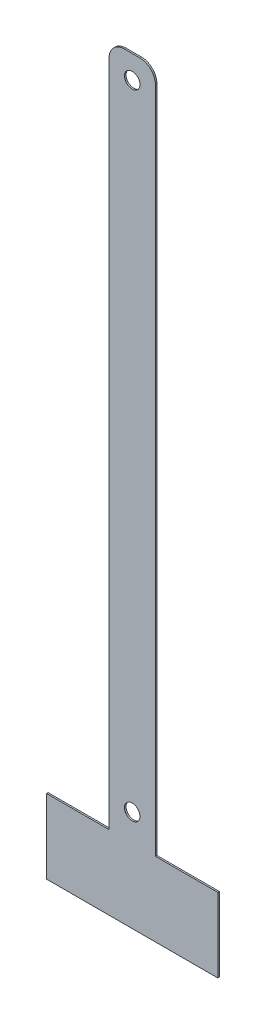
ISO-10303-21;
HEADER;
FILE_DESCRIPTION(('STEP AP214'),'2;1');
FILE_NAME('part.step','',(''),(''),'','','');
FILE_SCHEMA(('AUTOMOTIVE_DESIGN { 1 0 10303 214 1 1 1 1 }'));
ENDSEC;
DATA;
#1=APPLICATION_CONTEXT('core data for automotive mechanical design processes');
#2=APPLICATION_PROTOCOL_DEFINITION('international standard','automotive_design',2000,#1);
#3=PRODUCT_CONTEXT('',#1,'mechanical');
#4=PRODUCT('Part','Part','',(#3));
#5=PRODUCT_RELATED_PRODUCT_CATEGORY('part','',(#4));
#6=PRODUCT_DEFINITION_FORMATION('','',#4);
#7=PRODUCT_DEFINITION_CONTEXT('part definition',#1,'design');
#8=PRODUCT_DEFINITION('design','',#6,#7);
#9=PRODUCT_DEFINITION_SHAPE('','',#8);
#10=(LENGTH_UNIT() NAMED_UNIT(*) SI_UNIT(.MILLI.,.METRE.));
#11=(NAMED_UNIT(*) PLANE_ANGLE_UNIT() SI_UNIT($,.RADIAN.));
#12=(NAMED_UNIT(*) SI_UNIT($,.STERADIAN.) SOLID_ANGLE_UNIT());
#13=UNCERTAINTY_MEASURE_WITH_UNIT(LENGTH_MEASURE(1.E-05),#10,'distance_accuracy_value','');
#14=(GEOMETRIC_REPRESENTATION_CONTEXT(3) GLOBAL_UNCERTAINTY_ASSIGNED_CONTEXT((#13)) GLOBAL_UNIT_ASSIGNED_CONTEXT((#10,
#11,#12)) REPRESENTATION_CONTEXT('',''));
#15=CARTESIAN_POINT('',(0.,0.,0.));
#16=DIRECTION('',(0.,0.,1.));
#17=DIRECTION('',(1.,0.,0.));
#18=AXIS2_PLACEMENT_3D('',#15,#16,#17);
#19=CARTESIAN_POINT('',(0.,0.,1.));
#20=DIRECTION('',(0.,0.,1.));
#21=DIRECTION('',(1.,0.,0.));
#22=AXIS2_PLACEMENT_3D('',#19,#20,#21);
#23=PLANE('',#22);
#24=DIRECTION('',(-1.,0.,0.));
#25=VECTOR('',#24,1.);
#26=CARTESIAN_POINT('',(1.24668793806866E-13,-490.356194490192,1.00000000000022));
#27=LINE('',#26,#25);
#28=CARTESIAN_POINT('',(70.3561944901926,-490.356194490192,0.99999999999989));
#29=VERTEX_POINT('',#28);
#30=CARTESIAN_POINT('',(-40.3561944901921,-490.356194490192,1.00000000000011));
#31=VERTEX_POINT('',#30);
#32=EDGE_CURVE('E279',#29,#31,#27,.T.);
#33=ORIENTED_EDGE('',*,*,#32,.F.);
#34=DIRECTION('',(0.,1.,0.));
#35=VECTOR('',#34,1.);
#36=CARTESIAN_POINT('',(70.3561944901926,-490.356194490192,0.99999999999989));
#37=LINE('',#36,#35);
#38=CARTESIAN_POINT('',(70.3561944901926,-442.356194490192,0.999999999999612));
#39=VERTEX_POINT('',#38);
#40=EDGE_CURVE('E234',#39,#29,#37,.F.);
#41=ORIENTED_EDGE('',*,*,#40,.F.);
#42=DIRECTION('',(-1.,0.,0.));
#43=VECTOR('',#42,1.);
#44=CARTESIAN_POINT('',(32.3561944901927,-442.356194490192,0.999999999999834));
#45=LINE('',#44,#43);
#46=CARTESIAN_POINT('',(30.0000000000001,-442.356194490192,0.999999999999834));
#47=VERTEX_POINT('',#46);
#48=EDGE_CURVE('E253',#39,#47,#45,.T.);
#49=ORIENTED_EDGE('',*,*,#48,.T.);
#50=DIRECTION('',(0.,1.,0.));
#51=VECTOR('',#50,1.);
#52=CARTESIAN_POINT('',(30.0000000000001,-441.178097245096,1.));
#53=LINE('',#52,#51);
#54=CARTESIAN_POINT('',(30.,-10.,1.));
#55=VERTEX_POINT('',#54);
#56=EDGE_CURVE('E232',#47,#55,#53,.T.);
#57=ORIENTED_EDGE('',*,*,#56,.T.);
#58=CARTESIAN_POINT('',(20.,-10.,1.));
#59=DIRECTION('',(0.,0.,1.));
#60=DIRECTION('',(1.,0.,0.));
#61=AXIS2_PLACEMENT_3D('',#58,#59,#60);
#62=CIRCLE('',#61,10.);
#63=CARTESIAN_POINT('',(20.,0.,1.));
#64=VERTEX_POINT('',#63);
#65=EDGE_CURVE('E298',#55,#64,#62,.T.);
#66=ORIENTED_EDGE('',*,*,#65,.T.);
#67=DIRECTION('',(1.,0.,0.));
#68=VECTOR('',#67,1.);
#69=CARTESIAN_POINT('',(0.,0.,1.));
#70=LINE('',#69,#68);
#71=CARTESIAN_POINT('',(10.,0.,1.));
#72=VERTEX_POINT('',#71);
#73=EDGE_CURVE('E324',#72,#64,#70,.T.);
#74=ORIENTED_EDGE('',*,*,#73,.F.);
#75=CARTESIAN_POINT('',(10.,-10.,1.));
#76=DIRECTION('',(0.,0.,1.));
#77=DIRECTION('',(1.,0.,0.));
#78=AXIS2_PLACEMENT_3D('',#75,#76,#77);
#79=CIRCLE('',#78,10.);
#80=CARTESIAN_POINT('',(0.,-10.,1.));
#81=VERTEX_POINT('',#80);
#82=EDGE_CURVE('E321',#72,#81,#79,.T.);
#83=ORIENTED_EDGE('',*,*,#82,.T.);
#84=DIRECTION('',(0.,1.,0.));
#85=VECTOR('',#84,1.);
#86=CARTESIAN_POINT('',(1.35308431126191E-13,-441.178097245096,1.));
#87=LINE('',#86,#85);
#88=CARTESIAN_POINT('',(1.35308431126191E-13,-442.356194490192,1.));
#89=VERTEX_POINT('',#88);
#90=EDGE_CURVE('E203',#81,#89,#87,.F.);
#91=ORIENTED_EDGE('',*,*,#90,.T.);
#92=DIRECTION('',(-1.,0.,0.));
#93=VECTOR('',#92,1.);
#94=CARTESIAN_POINT('',(1.24768373731876E-13,-442.356194490192,1.));
#95=LINE('',#94,#93);
#96=CARTESIAN_POINT('',(-40.3561944901921,-442.356194490192,0.999999999999779));
#97=VERTEX_POINT('',#96);
#98=EDGE_CURVE('E273',#89,#97,#95,.T.);
#99=ORIENTED_EDGE('',*,*,#98,.T.);
#100=DIRECTION('',(0.,-1.,0.));
#101=VECTOR('',#100,1.);
#102=CARTESIAN_POINT('',(-40.3561944901921,-442.356194490192,0.999999999999779));
#103=LINE('',#102,#101);
#104=EDGE_CURVE('E256',#31,#97,#103,.F.);
#105=ORIENTED_EDGE('',*,*,#104,.F.);
#106=EDGE_LOOP('',(#33,#41,#49,#57,#66,#74,#83,#91,#99,#105));
#107=FACE_BOUND('',#106,.T.);
#108=CARTESIAN_POINT('',(15.,-425.,1.));
#109=DIRECTION('',(0.,0.,1.));
#110=DIRECTION('',(1.,0.,0.));
#111=AXIS2_PLACEMENT_3D('',#108,#109,#110);
#112=CIRCLE('',#111,4.99999999999999);
#113=CARTESIAN_POINT('',(20.,-425.,1.));
#114=VERTEX_POINT('',#113);
#115=EDGE_CURVE('E310',#114,#114,#112,.F.);
#116=ORIENTED_EDGE('',*,*,#115,.T.);
#117=EDGE_LOOP('',(#116));
#118=FACE_BOUND('',#117,.T.);
#119=CARTESIAN_POINT('',(15.,-15.,1.));
#120=DIRECTION('',(0.,0.,1.));
#121=DIRECTION('',(1.,0.,0.));
#122=AXIS2_PLACEMENT_3D('',#119,#120,#121);
#123=CIRCLE('',#122,5.);
#124=CARTESIAN_POINT('',(20.,-15.,1.));
#125=VERTEX_POINT('',#124);
#126=EDGE_CURVE('E226',#125,#125,#123,.T.);
#127=ORIENTED_EDGE('',*,*,#126,.F.);
#128=EDGE_LOOP('',(#127));
#129=FACE_BOUND('',#128,.T.);
#130=ADVANCED_FACE('F109',(#107,#118,#129),#23,.T.);
#131=CARTESIAN_POINT('',(0.,-441.356194490191,-1.11022302462516E-13));
#132=DIRECTION('',(0.,0.,1.));
#133=DIRECTION('',(0.,-1.,0.));
#134=AXIS2_PLACEMENT_3D('',#131,#132,#133);
#135=PLANE('',#134);
#136=DIRECTION('',(1.,0.,0.));
#137=VECTOR('',#136,1.);
#138=CARTESIAN_POINT('',(0.,-490.356194490192,2.22044604925031E-13));
#139=LINE('',#138,#137);
#140=CARTESIAN_POINT('',(70.3561944901926,-490.356194490192,-1.11022302462516E-13));
#141=VERTEX_POINT('',#140);
#142=CARTESIAN_POINT('',(-40.3561944901921,-490.356194490192,1.11022302462516E-13));
#143=VERTEX_POINT('',#142);
#144=EDGE_CURVE('E276',#141,#143,#139,.F.);
#145=ORIENTED_EDGE('',*,*,#144,.T.);
#146=DIRECTION('',(0.,1.,0.));
#147=VECTOR('',#146,1.);
#148=CARTESIAN_POINT('',(-40.3561944901921,-441.356194490191,-2.22044604925031E-13));
#149=LINE('',#148,#147);
#150=CARTESIAN_POINT('',(-40.3561944901921,-442.356194490192,-2.22044604925031E-13));
#151=VERTEX_POINT('',#150);
#152=EDGE_CURVE('E259',#143,#151,#149,.T.);
#153=ORIENTED_EDGE('',*,*,#152,.T.);
#154=DIRECTION('',(1.,0.,0.));
#155=VECTOR('',#154,1.);
#156=CARTESIAN_POINT('',(-1.17809724509605,-442.356194490192,0.));
#157=LINE('',#156,#155);
#158=CARTESIAN_POINT('',(1.24668793806866E-13,-442.356194490192,0.));
#159=VERTEX_POINT('',#158);
#160=EDGE_CURVE('E124',#159,#151,#157,.F.);
#161=ORIENTED_EDGE('',*,*,#160,.F.);
#162=DIRECTION('',(0.,1.,0.));
#163=VECTOR('',#162,1.);
#164=CARTESIAN_POINT('',(1.35308431126191E-13,-441.178097245096,0.));
#165=LINE('',#164,#163);
#166=CARTESIAN_POINT('',(0.,-10.,0.));
#167=VERTEX_POINT('',#166);
#168=EDGE_CURVE('E186',#167,#159,#165,.F.);
#169=ORIENTED_EDGE('',*,*,#168,.F.);
#170=CARTESIAN_POINT('',(10.,-10.,0.));
#171=DIRECTION('',(0.,0.,1.));
#172=DIRECTION('',(1.,0.,0.));
#173=AXIS2_PLACEMENT_3D('',#170,#171,#172);
#174=CIRCLE('',#173,10.);
#175=CARTESIAN_POINT('',(10.,0.,0.));
#176=VERTEX_POINT('',#175);
#177=EDGE_CURVE('E192',#176,#167,#174,.T.);
#178=ORIENTED_EDGE('',*,*,#177,.F.);
#179=DIRECTION('',(1.,0.,0.));
#180=VECTOR('',#179,1.);
#181=CARTESIAN_POINT('',(0.,0.,0.));
#182=LINE('',#181,#180);
#183=CARTESIAN_POINT('',(20.,0.,0.));
#184=VERTEX_POINT('',#183);
#185=EDGE_CURVE('E309',#176,#184,#182,.T.);
#186=ORIENTED_EDGE('',*,*,#185,.T.);
#187=CARTESIAN_POINT('',(20.,-10.,0.));
#188=DIRECTION('',(0.,0.,1.));
#189=DIRECTION('',(1.,0.,0.));
#190=AXIS2_PLACEMENT_3D('',#187,#188,#189);
#191=CIRCLE('',#190,10.);
#192=CARTESIAN_POINT('',(30.,-10.,0.));
#193=VERTEX_POINT('',#192);
#194=EDGE_CURVE('E215',#193,#184,#191,.T.);
#195=ORIENTED_EDGE('',*,*,#194,.F.);
#196=DIRECTION('',(0.,1.,0.));
#197=VECTOR('',#196,1.);
#198=CARTESIAN_POINT('',(30.0000000000001,-441.178097245096,0.));
#199=LINE('',#198,#197);
#200=CARTESIAN_POINT('',(30.0000000000001,-442.356194490192,0.));
#201=VERTEX_POINT('',#200);
#202=EDGE_CURVE('E196',#201,#193,#199,.T.);
#203=ORIENTED_EDGE('',*,*,#202,.F.);
#204=DIRECTION('',(1.,0.,0.));
#205=VECTOR('',#204,1.);
#206=CARTESIAN_POINT('',(31.1780972450963,-442.356194490192,0.));
#207=LINE('',#206,#205);
#208=CARTESIAN_POINT('',(70.3561944901926,-442.356194490192,-3.88578058618805E-13));
#209=VERTEX_POINT('',#208);
#210=EDGE_CURVE('E132',#209,#201,#207,.F.);
#211=ORIENTED_EDGE('',*,*,#210,.F.);
#212=DIRECTION('',(0.,-1.,0.));
#213=VECTOR('',#212,1.);
#214=CARTESIAN_POINT('',(70.3561944901926,-441.356194490191,-3.88578058618805E-13));
#215=LINE('',#214,#213);
#216=EDGE_CURVE('E238',#209,#141,#215,.T.);
#217=ORIENTED_EDGE('',*,*,#216,.T.);
#218=EDGE_LOOP('',(#145,#153,#161,#169,#178,#186,#195,#203,#211,#217));
#219=FACE_BOUND('',#218,.T.);
#220=CARTESIAN_POINT('',(15.,-425.,0.));
#221=DIRECTION('',(0.,0.,1.));
#222=DIRECTION('',(1.,0.,0.));
#223=AXIS2_PLACEMENT_3D('',#220,#221,#222);
#224=CIRCLE('',#223,4.99999999999999);
#225=CARTESIAN_POINT('',(20.,-425.,0.));
#226=VERTEX_POINT('',#225);
#227=EDGE_CURVE('E222',#226,#226,#224,.F.);
#228=ORIENTED_EDGE('',*,*,#227,.F.);
#229=EDGE_LOOP('',(#228));
#230=FACE_BOUND('',#229,.T.);
#231=CARTESIAN_POINT('',(15.,-15.,0.));
#232=DIRECTION('',(0.,0.,1.));
#233=DIRECTION('',(1.,0.,0.));
#234=AXIS2_PLACEMENT_3D('',#231,#232,#233);
#235=CIRCLE('',#234,5.);
#236=CARTESIAN_POINT('',(20.,-15.,0.));
#237=VERTEX_POINT('',#236);
#238=EDGE_CURVE('E197',#237,#237,#235,.T.);
#239=ORIENTED_EDGE('',*,*,#238,.T.);
#240=EDGE_LOOP('',(#239));
#241=FACE_BOUND('',#240,.T.);
#242=ADVANCED_FACE('F188',(#219,#230,#241),#135,.F.);
#243=CARTESIAN_POINT('',(1.24668793806866E-13,-490.356194490192,1.00000000000022));
#244=DIRECTION('',(0.,-1.,0.));
#245=DIRECTION('',(0.,0.,-1.));
#246=AXIS2_PLACEMENT_3D('',#243,#244,#245);
#247=PLANE('',#246);
#248=ORIENTED_EDGE('',*,*,#144,.F.);
#249=DIRECTION('',(0.,0.,1.));
#250=VECTOR('',#249,1.);
#251=CARTESIAN_POINT('',(70.3561944901926,-490.356194490192,-1.11022302462516E-13));
#252=LINE('',#251,#250);
#253=EDGE_CURVE('E242',#141,#29,#252,.T.);
#254=ORIENTED_EDGE('',*,*,#253,.T.);
#255=ORIENTED_EDGE('',*,*,#32,.T.);
#256=DIRECTION('',(0.,0.,1.));
#257=VECTOR('',#256,1.);
#258=CARTESIAN_POINT('',(-40.3561944901921,-490.356194490192,1.11022302462516E-13));
#259=LINE('',#258,#257);
#260=EDGE_CURVE('E266',#143,#31,#259,.T.);
#261=ORIENTED_EDGE('',*,*,#260,.F.);
#262=EDGE_LOOP('',(#248,#254,#255,#261));
#263=FACE_BOUND('',#262,.T.);
#264=ADVANCED_FACE('F337',(#263),#247,.T.);
#265=CARTESIAN_POINT('',(1.24768373731876E-13,-442.356194490192,1.));
#266=DIRECTION('',(0.,1.,0.));
#267=DIRECTION('',(-1.,0.,0.));
#268=AXIS2_PLACEMENT_3D('',#265,#266,#267);
#269=PLANE('',#268);
#270=DIRECTION('',(0.,0.,1.));
#271=VECTOR('',#270,1.);
#272=CARTESIAN_POINT('',(1.24668793806866E-13,-442.356194490192,-1.11022302462516E-13));
#273=LINE('',#272,#271);
#274=EDGE_CURVE('E13',#159,#89,#273,.T.);
#275=ORIENTED_EDGE('',*,*,#274,.F.);
#276=ORIENTED_EDGE('',*,*,#160,.T.);
#277=DIRECTION('',(0.,0.,1.));
#278=VECTOR('',#277,1.);
#279=CARTESIAN_POINT('',(-40.3561944901921,-442.356194490192,-2.22044604925031E-13));
#280=LINE('',#279,#278);
#281=EDGE_CURVE('E262',#151,#97,#280,.T.);
#282=ORIENTED_EDGE('',*,*,#281,.T.);
#283=ORIENTED_EDGE('',*,*,#98,.F.);
#284=EDGE_LOOP('',(#275,#276,#282,#283));
#285=FACE_BOUND('',#284,.T.);
#286=ADVANCED_FACE('F335',(#285),#269,.T.);
#287=CARTESIAN_POINT('',(-40.3561944901921,-442.356194490192,-2.22044604925031E-13));
#288=DIRECTION('',(1.,0.,0.));
#289=DIRECTION('',(0.,0.,-1.));
#290=AXIS2_PLACEMENT_3D('',#287,#288,#289);
#291=PLANE('',#290);
#292=ORIENTED_EDGE('',*,*,#104,.T.);
#293=ORIENTED_EDGE('',*,*,#281,.F.);
#294=ORIENTED_EDGE('',*,*,#152,.F.);
#295=ORIENTED_EDGE('',*,*,#260,.T.);
#296=EDGE_LOOP('',(#292,#293,#294,#295));
#297=FACE_BOUND('',#296,.T.);
#298=ADVANCED_FACE('F333',(#297),#291,.F.);
#299=CARTESIAN_POINT('',(32.3561944901927,-442.356194490192,0.999999999999834));
#300=DIRECTION('',(0.,1.,0.));
#301=DIRECTION('',(-1.,0.,0.));
#302=AXIS2_PLACEMENT_3D('',#299,#300,#301);
#303=PLANE('',#302);
#304=ORIENTED_EDGE('',*,*,#210,.T.);
#305=DIRECTION('',(0.,0.,1.));
#306=VECTOR('',#305,1.);
#307=CARTESIAN_POINT('',(30.0000000000001,-442.356194490192,0.99999999999989));
#308=LINE('',#307,#306);
#309=EDGE_CURVE('E117',#201,#47,#308,.T.);
#310=ORIENTED_EDGE('',*,*,#309,.T.);
#311=ORIENTED_EDGE('',*,*,#48,.F.);
#312=DIRECTION('',(0.,0.,1.));
#313=VECTOR('',#312,1.);
#314=CARTESIAN_POINT('',(70.3561944901926,-442.356194490192,-3.88578058618805E-13));
#315=LINE('',#314,#313);
#316=EDGE_CURVE('E246',#209,#39,#315,.T.);
#317=ORIENTED_EDGE('',*,*,#316,.F.);
#318=EDGE_LOOP('',(#304,#310,#311,#317));
#319=FACE_BOUND('',#318,.T.);
#320=ADVANCED_FACE('F285',(#319),#303,.T.);
#321=CARTESIAN_POINT('',(70.3561944901926,-490.356194490192,-1.11022302462516E-13));
#322=DIRECTION('',(-1.,0.,0.));
#323=DIRECTION('',(0.,0.,1.));
#324=AXIS2_PLACEMENT_3D('',#321,#322,#323);
#325=PLANE('',#324);
#326=ORIENTED_EDGE('',*,*,#40,.T.);
#327=ORIENTED_EDGE('',*,*,#253,.F.);
#328=ORIENTED_EDGE('',*,*,#216,.F.);
#329=ORIENTED_EDGE('',*,*,#316,.T.);
#330=EDGE_LOOP('',(#326,#327,#328,#329));
#331=FACE_BOUND('',#330,.T.);
#332=ADVANCED_FACE('F303',(#331),#325,.F.);
#333=CARTESIAN_POINT('',(1.35308431126191E-13,-441.178097245096,0.5));
#334=DIRECTION('',(1.,0.,0.));
#335=DIRECTION('',(0.,1.,0.));
#336=AXIS2_PLACEMENT_3D('',#333,#334,#335);
#337=PLANE('',#336);
#338=ORIENTED_EDGE('',*,*,#90,.F.);
#339=DIRECTION('',(0.,0.,1.));
#340=VECTOR('',#339,1.);
#341=CARTESIAN_POINT('',(0.,-10.,1.));
#342=LINE('',#341,#340);
#343=EDGE_CURVE('E200',#167,#81,#342,.T.);
#344=ORIENTED_EDGE('',*,*,#343,.F.);
#345=ORIENTED_EDGE('',*,*,#168,.T.);
#346=ORIENTED_EDGE('',*,*,#274,.T.);
#347=EDGE_LOOP('',(#338,#344,#345,#346));
#348=FACE_BOUND('',#347,.T.);
#349=ADVANCED_FACE('F201',(#348),#337,.F.);
#350=CARTESIAN_POINT('',(30.0000000000001,-441.178097245096,0.5));
#351=DIRECTION('',(1.,0.,0.));
#352=DIRECTION('',(0.,1.,0.));
#353=AXIS2_PLACEMENT_3D('',#350,#351,#352);
#354=PLANE('',#353);
#355=ORIENTED_EDGE('',*,*,#202,.T.);
#356=DIRECTION('',(0.,0.,1.));
#357=VECTOR('',#356,1.);
#358=CARTESIAN_POINT('',(30.,-10.,1.));
#359=LINE('',#358,#357);
#360=EDGE_CURVE('E292',#193,#55,#359,.T.);
#361=ORIENTED_EDGE('',*,*,#360,.T.);
#362=ORIENTED_EDGE('',*,*,#56,.F.);
#363=ORIENTED_EDGE('',*,*,#309,.F.);
#364=EDGE_LOOP('',(#355,#361,#362,#363));
#365=FACE_BOUND('',#364,.T.);
#366=ADVANCED_FACE('F290',(#365),#354,.T.);
#367=CARTESIAN_POINT('',(15.,-15.,1.));
#368=DIRECTION('',(0.,0.,1.));
#369=DIRECTION('',(1.,0.,0.));
#370=AXIS2_PLACEMENT_3D('',#367,#368,#369);
#371=CYLINDRICAL_SURFACE('',#370,5.);
#372=ORIENTED_EDGE('',*,*,#126,.T.);
#373=EDGE_LOOP('',(#372));
#374=FACE_BOUND('',#373,.T.);
#375=ORIENTED_EDGE('',*,*,#238,.F.);
#376=EDGE_LOOP('',(#375));
#377=FACE_BOUND('',#376,.T.);
#378=ADVANCED_FACE('F365',(#374,#377),#371,.F.);
#379=CARTESIAN_POINT('',(15.,-425.,1.));
#380=DIRECTION('',(0.,0.,1.));
#381=DIRECTION('',(1.,0.,0.));
#382=AXIS2_PLACEMENT_3D('',#379,#380,#381);
#383=CYLINDRICAL_SURFACE('',#382,4.99999999999999);
#384=ORIENTED_EDGE('',*,*,#115,.F.);
#385=EDGE_LOOP('',(#384));
#386=FACE_BOUND('',#385,.T.);
#387=ORIENTED_EDGE('',*,*,#227,.T.);
#388=EDGE_LOOP('',(#387));
#389=FACE_BOUND('',#388,.T.);
#390=ADVANCED_FACE('F375',(#386,#389),#383,.F.);
#391=CARTESIAN_POINT('',(20.,-10.,1.));
#392=DIRECTION('',(0.,0.,1.));
#393=DIRECTION('',(1.,0.,0.));
#394=AXIS2_PLACEMENT_3D('',#391,#392,#393);
#395=CYLINDRICAL_SURFACE('',#394,10.);
#396=ORIENTED_EDGE('',*,*,#360,.F.);
#397=ORIENTED_EDGE('',*,*,#194,.T.);
#398=DIRECTION('',(0.,0.,1.));
#399=VECTOR('',#398,1.);
#400=CARTESIAN_POINT('',(20.,0.,1.));
#401=LINE('',#400,#399);
#402=EDGE_CURVE('E212',#184,#64,#401,.T.);
#403=ORIENTED_EDGE('',*,*,#402,.T.);
#404=ORIENTED_EDGE('',*,*,#65,.F.);
#405=EDGE_LOOP('',(#396,#397,#403,#404));
#406=FACE_BOUND('',#405,.T.);
#407=ADVANCED_FACE('F307',(#406),#395,.T.);
#408=CARTESIAN_POINT('',(10.,-10.,1.));
#409=DIRECTION('',(0.,0.,1.));
#410=DIRECTION('',(1.,0.,0.));
#411=AXIS2_PLACEMENT_3D('',#408,#409,#410);
#412=CYLINDRICAL_SURFACE('',#411,10.);
#413=ORIENTED_EDGE('',*,*,#177,.T.);
#414=ORIENTED_EDGE('',*,*,#343,.T.);
#415=ORIENTED_EDGE('',*,*,#82,.F.);
#416=DIRECTION('',(0.,0.,1.));
#417=VECTOR('',#416,1.);
#418=CARTESIAN_POINT('',(10.,0.,1.));
#419=LINE('',#418,#417);
#420=EDGE_CURVE('E208',#176,#72,#419,.T.);
#421=ORIENTED_EDGE('',*,*,#420,.F.);
#422=EDGE_LOOP('',(#413,#414,#415,#421));
#423=FACE_BOUND('',#422,.T.);
#424=ADVANCED_FACE('F210',(#423),#412,.T.);
#425=CARTESIAN_POINT('',(0.,0.,1.));
#426=DIRECTION('',(0.,-1.,0.));
#427=DIRECTION('',(1.,0.,0.));
#428=AXIS2_PLACEMENT_3D('',#425,#426,#427);
#429=PLANE('',#428);
#430=ORIENTED_EDGE('',*,*,#402,.F.);
#431=ORIENTED_EDGE('',*,*,#185,.F.);
#432=ORIENTED_EDGE('',*,*,#420,.T.);
#433=ORIENTED_EDGE('',*,*,#73,.T.);
#434=EDGE_LOOP('',(#430,#431,#432,#433));
#435=FACE_BOUND('',#434,.T.);
#436=ADVANCED_FACE('F329',(#435),#429,.F.);
#437=CLOSED_SHELL('',(#130,#242,#264,#286,#298,#320,#332,#349,#366,#378,#390,#407,#424,#436));
#438=MANIFOLD_SOLID_BREP('B2',#437);
#439=ADVANCED_BREP_SHAPE_REPRESENTATION('',(#18,#438),#14);
#440=SHAPE_DEFINITION_REPRESENTATION(#9,#439);
ENDSEC;
END-ISO-10303-21;
